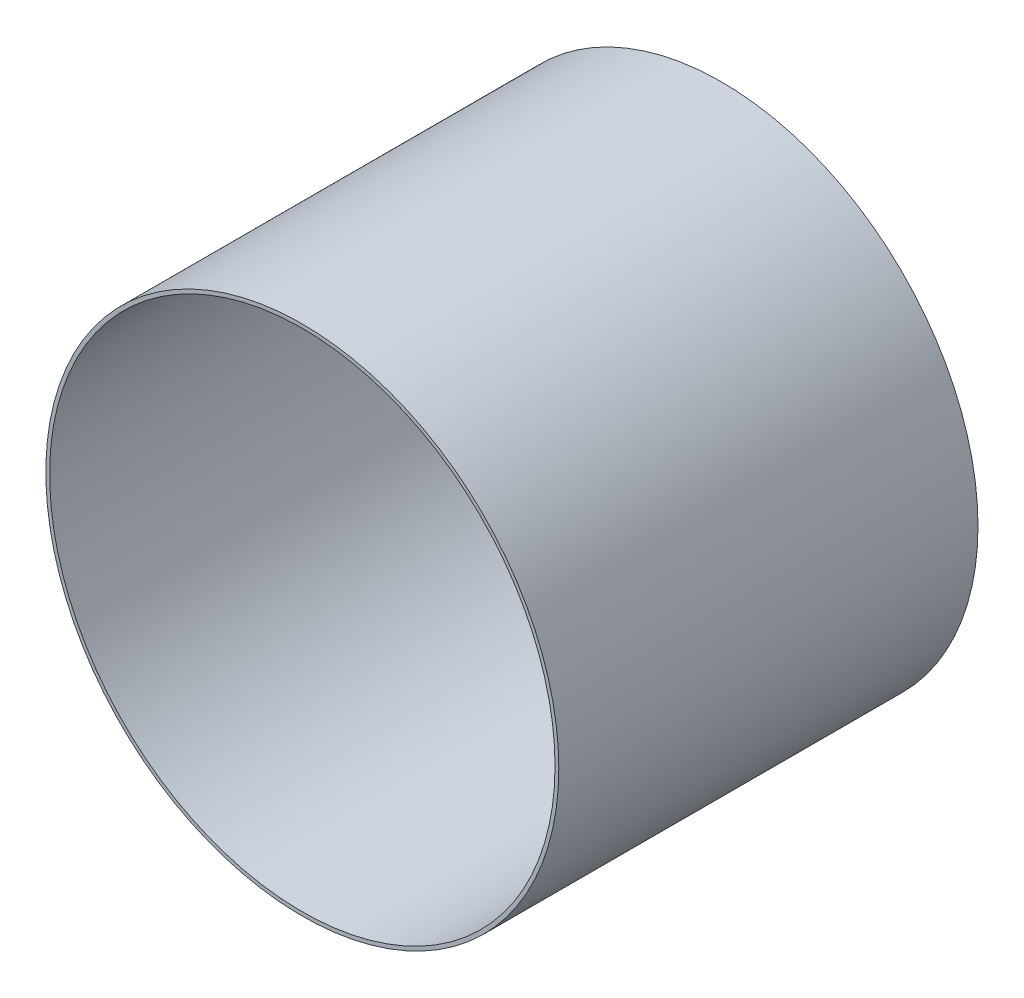
ISO-10303-21;
HEADER;
FILE_DESCRIPTION(('STEP AP214'),'2;1');
FILE_NAME('part.step','',(''),(''),'','','');
FILE_SCHEMA(('AUTOMOTIVE_DESIGN { 1 0 10303 214 1 1 1 1 }'));
ENDSEC;
DATA;
#1=APPLICATION_CONTEXT('core data for automotive mechanical design processes');
#2=APPLICATION_PROTOCOL_DEFINITION('international standard','automotive_design',2000,#1);
#3=PRODUCT_CONTEXT('',#1,'mechanical');
#4=PRODUCT('Part','Part','',(#3));
#5=PRODUCT_RELATED_PRODUCT_CATEGORY('part','',(#4));
#6=PRODUCT_DEFINITION_FORMATION('','',#4);
#7=PRODUCT_DEFINITION_CONTEXT('part definition',#1,'design');
#8=PRODUCT_DEFINITION('design','',#6,#7);
#9=PRODUCT_DEFINITION_SHAPE('','',#8);
#10=(LENGTH_UNIT() NAMED_UNIT(*) SI_UNIT(.MILLI.,.METRE.));
#11=(NAMED_UNIT(*) PLANE_ANGLE_UNIT() SI_UNIT($,.RADIAN.));
#12=(NAMED_UNIT(*) SI_UNIT($,.STERADIAN.) SOLID_ANGLE_UNIT());
#13=UNCERTAINTY_MEASURE_WITH_UNIT(LENGTH_MEASURE(1.E-05),#10,'distance_accuracy_value','');
#14=(GEOMETRIC_REPRESENTATION_CONTEXT(3) GLOBAL_UNCERTAINTY_ASSIGNED_CONTEXT((#13)) GLOBAL_UNIT_ASSIGNED_CONTEXT((#10,
#11,#12)) REPRESENTATION_CONTEXT('',''));
#15=CARTESIAN_POINT('',(0.,0.,0.));
#16=DIRECTION('',(0.,0.,1.));
#17=DIRECTION('',(1.,0.,0.));
#18=AXIS2_PLACEMENT_3D('',#15,#16,#17);
#19=CARTESIAN_POINT('',(0.,0.,0.));
#20=DIRECTION('',(0.,0.,-1.));
#21=DIRECTION('',(1.,0.,0.));
#22=AXIS2_PLACEMENT_3D('',#19,#20,#21);
#23=CYLINDRICAL_SURFACE('',#22,1.72539914);
#24=CARTESIAN_POINT('',(0.,0.,2.81999944));
#25=DIRECTION('',(0.,0.,1.));
#26=DIRECTION('',(1.,0.,0.));
#27=AXIS2_PLACEMENT_3D('',#24,#25,#26);
#28=CIRCLE('',#27,1.72539914);
#29=CARTESIAN_POINT('',(1.72539914,0.,2.81999944));
#30=VERTEX_POINT('',#29);
#31=EDGE_CURVE('E11',#30,#30,#28,.T.);
#32=ORIENTED_EDGE('',*,*,#31,.F.);
#33=DIRECTION('',(0.,0.,1.));
#34=VECTOR('',#33,1.);
#35=CARTESIAN_POINT('',(1.72539914,0.,0.));
#36=LINE('',#35,#34);
#37=CARTESIAN_POINT('',(1.72539914,0.,0.));
#38=VERTEX_POINT('',#37);
#39=EDGE_CURVE('E24',#38,#30,#36,.T.);
#40=ORIENTED_EDGE('',*,*,#39,.F.);
#41=CARTESIAN_POINT('',(0.,0.,0.));
#42=DIRECTION('',(0.,0.,1.));
#43=DIRECTION('',(1.,0.,0.));
#44=AXIS2_PLACEMENT_3D('',#41,#42,#43);
#45=CIRCLE('',#44,1.72539914);
#46=EDGE_CURVE('E46',#38,#38,#45,.T.);
#47=ORIENTED_EDGE('',*,*,#46,.T.);
#48=ORIENTED_EDGE('',*,*,#39,.T.);
#49=EDGE_LOOP('',(#32,#40,#47,#48));
#50=FACE_BOUND('',#49,.T.);
#51=ADVANCED_FACE('F17',(#50),#23,.T.);
#52=CARTESIAN_POINT('',(0.,0.,0.));
#53=DIRECTION('',(0.,0.,-1.));
#54=DIRECTION('',(1.,0.,0.));
#55=AXIS2_PLACEMENT_3D('',#52,#53,#54);
#56=CYLINDRICAL_SURFACE('',#55,1.69999914);
#57=DIRECTION('',(0.,0.,1.));
#58=VECTOR('',#57,1.);
#59=CARTESIAN_POINT('',(1.69999914,0.,0.));
#60=LINE('',#59,#58);
#61=CARTESIAN_POINT('',(1.69999914,0.,0.));
#62=VERTEX_POINT('',#61);
#63=CARTESIAN_POINT('',(1.69999914,0.,2.81999944));
#64=VERTEX_POINT('',#63);
#65=EDGE_CURVE('E40',#62,#64,#60,.T.);
#66=ORIENTED_EDGE('',*,*,#65,.T.);
#67=CARTESIAN_POINT('',(0.,0.,2.81999944));
#68=DIRECTION('',(0.,0.,1.));
#69=DIRECTION('',(1.,0.,0.));
#70=AXIS2_PLACEMENT_3D('',#67,#68,#69);
#71=CIRCLE('',#70,1.69999914);
#72=EDGE_CURVE('E45',#64,#64,#71,.T.);
#73=ORIENTED_EDGE('',*,*,#72,.T.);
#74=ORIENTED_EDGE('',*,*,#65,.F.);
#75=CARTESIAN_POINT('',(0.,0.,0.));
#76=DIRECTION('',(0.,0.,1.));
#77=DIRECTION('',(1.,0.,0.));
#78=AXIS2_PLACEMENT_3D('',#75,#76,#77);
#79=CIRCLE('',#78,1.69999914);
#80=EDGE_CURVE('E43',#62,#62,#79,.T.);
#81=ORIENTED_EDGE('',*,*,#80,.F.);
#82=EDGE_LOOP('',(#66,#73,#74,#81));
#83=FACE_BOUND('',#82,.T.);
#84=ADVANCED_FACE('F42',(#83),#56,.F.);
#85=CARTESIAN_POINT('',(1.72539914,0.,0.));
#86=DIRECTION('',(0.,0.,-1.));
#87=DIRECTION('',(-1.,0.,0.));
#88=AXIS2_PLACEMENT_3D('',#85,#86,#87);
#89=PLANE('',#88);
#90=ORIENTED_EDGE('',*,*,#46,.F.);
#91=EDGE_LOOP('',(#90));
#92=FACE_BOUND('',#91,.T.);
#93=ORIENTED_EDGE('',*,*,#80,.T.);
#94=EDGE_LOOP('',(#93));
#95=FACE_BOUND('',#94,.T.);
#96=ADVANCED_FACE('F49',(#92,#95),#89,.T.);
#97=CARTESIAN_POINT('',(1.72539914,0.,2.81999944));
#98=DIRECTION('',(0.,0.,-1.));
#99=DIRECTION('',(-1.,0.,0.));
#100=AXIS2_PLACEMENT_3D('',#97,#98,#99);
#101=PLANE('',#100);
#102=ORIENTED_EDGE('',*,*,#31,.T.);
#103=EDGE_LOOP('',(#102));
#104=FACE_BOUND('',#103,.T.);
#105=ORIENTED_EDGE('',*,*,#72,.F.);
#106=EDGE_LOOP('',(#105));
#107=FACE_BOUND('',#106,.T.);
#108=ADVANCED_FACE('F56',(#104,#107),#101,.F.);
#109=CLOSED_SHELL('',(#51,#84,#96,#108));
#110=MANIFOLD_SOLID_BREP('B1',#109);
#111=ADVANCED_BREP_SHAPE_REPRESENTATION('',(#18,#110),#14);
#112=SHAPE_DEFINITION_REPRESENTATION(#9,#111);
ENDSEC;
END-ISO-10303-21;
